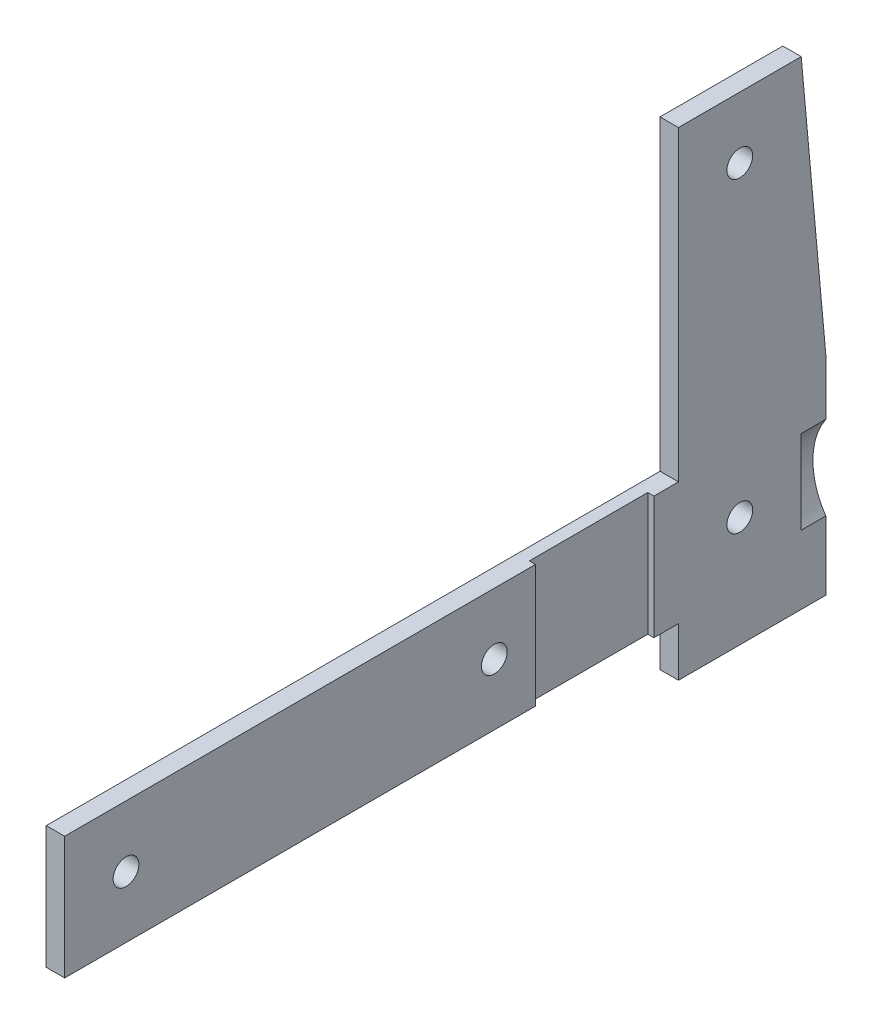
ISO-10303-21;
HEADER;
FILE_DESCRIPTION(('STEP AP214'),'2;1');
FILE_NAME('part.step','',(''),(''),'','','');
FILE_SCHEMA(('AUTOMOTIVE_DESIGN { 1 0 10303 214 1 1 1 1 }'));
ENDSEC;
DATA;
#1=APPLICATION_CONTEXT('core data for automotive mechanical design processes');
#2=APPLICATION_PROTOCOL_DEFINITION('international standard','automotive_design',2000,#1);
#3=PRODUCT_CONTEXT('',#1,'mechanical');
#4=PRODUCT('Part','Part','',(#3));
#5=PRODUCT_RELATED_PRODUCT_CATEGORY('part','',(#4));
#6=PRODUCT_DEFINITION_FORMATION('','',#4);
#7=PRODUCT_DEFINITION_CONTEXT('part definition',#1,'design');
#8=PRODUCT_DEFINITION('design','',#6,#7);
#9=PRODUCT_DEFINITION_SHAPE('','',#8);
#10=(LENGTH_UNIT() NAMED_UNIT(*) SI_UNIT(.MILLI.,.METRE.));
#11=(NAMED_UNIT(*) PLANE_ANGLE_UNIT() SI_UNIT($,.RADIAN.));
#12=(NAMED_UNIT(*) SI_UNIT($,.STERADIAN.) SOLID_ANGLE_UNIT());
#13=UNCERTAINTY_MEASURE_WITH_UNIT(LENGTH_MEASURE(1.E-05),#10,'distance_accuracy_value','');
#14=(GEOMETRIC_REPRESENTATION_CONTEXT(3) GLOBAL_UNCERTAINTY_ASSIGNED_CONTEXT((#13)) GLOBAL_UNIT_ASSIGNED_CONTEXT((#10,
#11,#12)) REPRESENTATION_CONTEXT('',''));
#15=CARTESIAN_POINT('',(0.,0.,0.));
#16=DIRECTION('',(0.,0.,1.));
#17=DIRECTION('',(1.,0.,0.));
#18=AXIS2_PLACEMENT_3D('',#15,#16,#17);
#19=CARTESIAN_POINT('',(0.,0.,309.000000000001));
#20=DIRECTION('',(0.,0.,1.));
#21=DIRECTION('',(0.,-1.,0.));
#22=AXIS2_PLACEMENT_3D('',#19,#20,#21);
#23=PLANE('',#22);
#24=CARTESIAN_POINT('',(0.,0.,309.000000000001));
#25=DIRECTION('',(0.,0.,-1.));
#26=DIRECTION('',(0.,1.,0.));
#27=AXIS2_PLACEMENT_3D('',#24,#25,#26);
#28=CIRCLE('',#27,12.1);
#29=CARTESIAN_POINT('',(-9.99999999999999,-6.81248853210037,309.000000000001));
#30=VERTEX_POINT('',#29);
#31=CARTESIAN_POINT('',(-9.99999999999999,6.8124885321005,309.000000000001));
#32=VERTEX_POINT('',#31);
#33=EDGE_CURVE('E19',#30,#32,#28,.T.);
#34=ORIENTED_EDGE('',*,*,#33,.T.);
#35=DIRECTION('',(0.,-1.,0.));
#36=VECTOR('',#35,1.);
#37=CARTESIAN_POINT('',(-10.,20.9999999999999,309.000000000001));
#38=LINE('',#37,#36);
#39=EDGE_CURVE('E120',#32,#30,#38,.T.);
#40=ORIENTED_EDGE('',*,*,#39,.T.);
#41=EDGE_LOOP('',(#34,#40));
#42=FACE_BOUND('',#41,.T.);
#43=ADVANCED_FACE('F16',(#42),#23,.F.);
#44=CARTESIAN_POINT('',(-10.,9.99999999999988,333.000000000001));
#45=DIRECTION('',(0.,0.,-1.));
#46=DIRECTION('',(-1.,0.,0.));
#47=AXIS2_PLACEMENT_3D('',#44,#45,#46);
#48=PLANE('',#47);
#49=DIRECTION('',(-1.,0.,0.));
#50=VECTOR('',#49,1.);
#51=CARTESIAN_POINT('',(-10.,9.99999999999988,333.000000000001));
#52=LINE('',#51,#50);
#53=CARTESIAN_POINT('',(-11.,9.99999999999988,333.000000000001));
#54=VERTEX_POINT('',#53);
#55=CARTESIAN_POINT('',(-10.,9.99999999999988,333.000000000001));
#56=VERTEX_POINT('',#55);
#57=EDGE_CURVE('E150',#54,#56,#52,.F.);
#58=ORIENTED_EDGE('',*,*,#57,.F.);
#59=DIRECTION('',(0.,1.,0.));
#60=VECTOR('',#59,1.);
#61=CARTESIAN_POINT('',(-11.,-1.4432899320127E-13,333.000000000001));
#62=LINE('',#61,#60);
#63=CARTESIAN_POINT('',(-11.,-10.0000000000002,333.000000000001));
#64=VERTEX_POINT('',#63);
#65=EDGE_CURVE('E141',#54,#64,#62,.F.);
#66=ORIENTED_EDGE('',*,*,#65,.T.);
#67=DIRECTION('',(-1.,0.,0.));
#68=VECTOR('',#67,1.);
#69=CARTESIAN_POINT('',(-10.,-10.0000000000002,333.000000000001));
#70=LINE('',#69,#68);
#71=CARTESIAN_POINT('',(-9.99999999999999,-10.0000000000002,333.000000000001));
#72=VERTEX_POINT('',#71);
#73=EDGE_CURVE('E152',#72,#64,#70,.T.);
#74=ORIENTED_EDGE('',*,*,#73,.F.);
#75=DIRECTION('',(0.,-1.,0.));
#76=VECTOR('',#75,1.);
#77=CARTESIAN_POINT('',(-10.,20.9999999999999,333.000000000001));
#78=LINE('',#77,#76);
#79=EDGE_CURVE('E136',#72,#56,#78,.F.);
#80=ORIENTED_EDGE('',*,*,#79,.T.);
#81=EDGE_LOOP('',(#58,#66,#74,#80));
#82=FACE_BOUND('',#81,.T.);
#83=ADVANCED_FACE('F263',(#82),#48,.F.);
#84=CARTESIAN_POINT('',(-10.,-10.0000000000002,352.300000000001));
#85=DIRECTION('',(0.,0.,1.));
#86=DIRECTION('',(1.,0.,0.));
#87=AXIS2_PLACEMENT_3D('',#84,#85,#86);
#88=PLANE('',#87);
#89=DIRECTION('',(1.,0.,0.));
#90=VECTOR('',#89,1.);
#91=CARTESIAN_POINT('',(-10.,-10.0000000000002,352.300000000001));
#92=LINE('',#91,#90);
#93=CARTESIAN_POINT('',(-11.,-10.0000000000002,352.300000000001));
#94=VERTEX_POINT('',#93);
#95=CARTESIAN_POINT('',(-10.,-10.0000000000002,352.300000000001));
#96=VERTEX_POINT('',#95);
#97=EDGE_CURVE('E126',#94,#96,#92,.T.);
#98=ORIENTED_EDGE('',*,*,#97,.F.);
#99=DIRECTION('',(0.,1.,0.));
#100=VECTOR('',#99,1.);
#101=CARTESIAN_POINT('',(-11.,-1.4432899320127E-13,352.300000000001));
#102=LINE('',#101,#100);
#103=CARTESIAN_POINT('',(-11.,9.99999999999988,352.300000000001));
#104=VERTEX_POINT('',#103);
#105=EDGE_CURVE('E125',#94,#104,#102,.T.);
#106=ORIENTED_EDGE('',*,*,#105,.T.);
#107=DIRECTION('',(1.,0.,0.));
#108=VECTOR('',#107,1.);
#109=CARTESIAN_POINT('',(-10.,9.99999999999988,352.300000000001));
#110=LINE('',#109,#108);
#111=CARTESIAN_POINT('',(-10.,9.99999999999988,352.300000000001));
#112=VERTEX_POINT('',#111);
#113=EDGE_CURVE('E148',#112,#104,#110,.F.);
#114=ORIENTED_EDGE('',*,*,#113,.F.);
#115=DIRECTION('',(0.,-1.,0.));
#116=VECTOR('',#115,1.);
#117=CARTESIAN_POINT('',(-10.,20.9999999999999,352.300000000001));
#118=LINE('',#117,#116);
#119=EDGE_CURVE('E135',#112,#96,#118,.T.);
#120=ORIENTED_EDGE('',*,*,#119,.T.);
#121=EDGE_LOOP('',(#98,#106,#114,#120));
#122=FACE_BOUND('',#121,.T.);
#123=ADVANCED_FACE('F256',(#122),#88,.F.);
#124=CARTESIAN_POINT('',(0.,0.,309.000000000001));
#125=DIRECTION('',(0.,0.,-1.));
#126=DIRECTION('',(0.,1.,0.));
#127=AXIS2_PLACEMENT_3D('',#124,#125,#126);
#128=CYLINDRICAL_SURFACE('',#127,12.1);
#129=ORIENTED_EDGE('',*,*,#33,.F.);
#130=DIRECTION('',(0.,0.,1.));
#131=VECTOR('',#130,1.);
#132=CARTESIAN_POINT('',(-9.99999999999999,-6.81248853210035,367.000000000001));
#133=LINE('',#132,#131);
#134=CARTESIAN_POINT('',(-9.99999999999999,-6.81248853210036,305.000000000001));
#135=VERTEX_POINT('',#134);
#136=EDGE_CURVE('E140',#30,#135,#133,.F.);
#137=ORIENTED_EDGE('',*,*,#136,.T.);
#138=CARTESIAN_POINT('',(0.,0.,305.000000000001));
#139=DIRECTION('',(0.,0.,-1.));
#140=DIRECTION('',(0.,1.,0.));
#141=AXIS2_PLACEMENT_3D('',#138,#139,#140);
#142=CIRCLE('',#141,12.1);
#143=CARTESIAN_POINT('',(-10.,6.8124885321005,305.000000000001));
#144=VERTEX_POINT('',#143);
#145=EDGE_CURVE('E131',#144,#135,#142,.F.);
#146=ORIENTED_EDGE('',*,*,#145,.F.);
#147=DIRECTION('',(0.,0.,1.));
#148=VECTOR('',#147,1.);
#149=CARTESIAN_POINT('',(-9.99999999999999,6.81248853210048,367.000000000001));
#150=LINE('',#149,#148);
#151=EDGE_CURVE('E128',#144,#32,#150,.T.);
#152=ORIENTED_EDGE('',*,*,#151,.T.);
#153=EDGE_LOOP('',(#129,#137,#146,#152));
#154=FACE_BOUND('',#153,.T.);
#155=ADVANCED_FACE('F129',(#154),#128,.F.);
#156=CARTESIAN_POINT('',(-11.,-1.4432899320127E-13,342.650000000001));
#157=DIRECTION('',(-1.,0.,0.));
#158=DIRECTION('',(0.,0.,1.));
#159=AXIS2_PLACEMENT_3D('',#156,#157,#158);
#160=PLANE('',#159);
#161=ORIENTED_EDGE('',*,*,#65,.F.);
#162=DIRECTION('',(0.,0.,1.));
#163=VECTOR('',#162,1.);
#164=CARTESIAN_POINT('',(-11.,9.99999999999987,429.000000000001));
#165=LINE('',#164,#163);
#166=EDGE_CURVE('E166',#104,#54,#165,.F.);
#167=ORIENTED_EDGE('',*,*,#166,.F.);
#168=ORIENTED_EDGE('',*,*,#105,.F.);
#169=DIRECTION('',(0.,0.,1.));
#170=VECTOR('',#169,1.);
#171=CARTESIAN_POINT('',(-11.,-10.0000000000002,329.000000000001));
#172=LINE('',#171,#170);
#173=EDGE_CURVE('E173',#64,#94,#172,.T.);
#174=ORIENTED_EDGE('',*,*,#173,.F.);
#175=EDGE_LOOP('',(#161,#167,#168,#174));
#176=FACE_BOUND('',#175,.T.);
#177=ADVANCED_FACE('F261',(#176),#160,.F.);
#178=CARTESIAN_POINT('',(-10.,20.9999999999999,367.000000000001));
#179=DIRECTION('',(-1.,0.,0.));
#180=DIRECTION('',(0.,-1.,0.));
#181=AXIS2_PLACEMENT_3D('',#178,#179,#180);
#182=PLANE('',#181);
#183=CARTESIAN_POINT('',(-10.,-1.19583449414767E-13,319.000000000001));
#184=DIRECTION('',(-1.,0.,0.));
#185=DIRECTION('',(0.,-1.,0.));
#186=AXIS2_PLACEMENT_3D('',#183,#184,#185);
#187=CIRCLE('',#186,2.09999999999999);
#188=CARTESIAN_POINT('',(-10.,-2.10000000000011,319.000000000001));
#189=VERTEX_POINT('',#188);
#190=EDGE_CURVE('E161',#189,#189,#187,.T.);
#191=ORIENTED_EDGE('',*,*,#190,.T.);
#192=EDGE_LOOP('',(#191));
#193=FACE_BOUND('',#192,.T.);
#194=CARTESIAN_POINT('',(-10.,49.9999999999999,319.000000000001));
#195=DIRECTION('',(-1.,0.,0.));
#196=DIRECTION('',(0.,-1.,0.));
#197=AXIS2_PLACEMENT_3D('',#194,#195,#196);
#198=CIRCLE('',#197,2.1);
#199=CARTESIAN_POINT('',(-10.,47.8999999999999,319.000000000001));
#200=VERTEX_POINT('',#199);
#201=EDGE_CURVE('E196',#200,#200,#198,.T.);
#202=ORIENTED_EDGE('',*,*,#201,.T.);
#203=EDGE_LOOP('',(#202));
#204=FACE_BOUND('',#203,.T.);
#205=DIRECTION('',(0.,1.,0.));
#206=VECTOR('',#205,1.);
#207=CARTESIAN_POINT('',(-10.,16.0497443313968,305.000000000001));
#208=LINE('',#207,#206);
#209=CARTESIAN_POINT('',(-10.,16.0497443313968,305.000000000001));
#210=VERTEX_POINT('',#209);
#211=EDGE_CURVE('E297',#210,#144,#208,.F.);
#212=ORIENTED_EDGE('',*,*,#211,.F.);
#213=DIRECTION('',(0.,0.995883962151565,0.0906373760062565));
#214=VECTOR('',#213,1.);
#215=CARTESIAN_POINT('',(-10.,59.9999999999999,309.000000000001));
#216=LINE('',#215,#214);
#217=CARTESIAN_POINT('',(-10.,59.9999999999999,309.000000000001));
#218=VERTEX_POINT('',#217);
#219=EDGE_CURVE('E207',#218,#210,#216,.F.);
#220=ORIENTED_EDGE('',*,*,#219,.F.);
#221=DIRECTION('',(0.,0.,1.));
#222=VECTOR('',#221,1.);
#223=CARTESIAN_POINT('',(-10.,59.9999999999999,329.000000000001));
#224=LINE('',#223,#222);
#225=CARTESIAN_POINT('',(-10.,59.9999999999999,329.000000000001));
#226=VERTEX_POINT('',#225);
#227=EDGE_CURVE('E226',#226,#218,#224,.F.);
#228=ORIENTED_EDGE('',*,*,#227,.F.);
#229=DIRECTION('',(0.,-1.,0.));
#230=VECTOR('',#229,1.);
#231=CARTESIAN_POINT('',(-10.,9.99999999999988,329.000000000001));
#232=LINE('',#231,#230);
#233=CARTESIAN_POINT('',(-10.,9.99999999999988,329.000000000001));
#234=VERTEX_POINT('',#233);
#235=EDGE_CURVE('E169',#234,#226,#232,.F.);
#236=ORIENTED_EDGE('',*,*,#235,.F.);
#237=DIRECTION('',(0.,0.,1.));
#238=VECTOR('',#237,1.);
#239=CARTESIAN_POINT('',(-10.,9.99999999999987,429.000000000001));
#240=LINE('',#239,#238);
#241=EDGE_CURVE('E229',#56,#234,#240,.F.);
#242=ORIENTED_EDGE('',*,*,#241,.F.);
#243=ORIENTED_EDGE('',*,*,#79,.F.);
#244=DIRECTION('',(0.,0.,1.));
#245=VECTOR('',#244,1.);
#246=CARTESIAN_POINT('',(-10.,-10.0000000000002,329.000000000001));
#247=LINE('',#246,#245);
#248=CARTESIAN_POINT('',(-10.,-10.0000000000002,329.000000000001));
#249=VERTEX_POINT('',#248);
#250=EDGE_CURVE('E158',#249,#72,#247,.T.);
#251=ORIENTED_EDGE('',*,*,#250,.F.);
#252=DIRECTION('',(0.,-1.,0.));
#253=VECTOR('',#252,1.);
#254=CARTESIAN_POINT('',(-10.,-18.,329.000000000001));
#255=LINE('',#254,#253);
#256=CARTESIAN_POINT('',(-9.99999999999999,-18.,329.000000000001));
#257=VERTEX_POINT('',#256);
#258=EDGE_CURVE('E294',#257,#249,#255,.F.);
#259=ORIENTED_EDGE('',*,*,#258,.F.);
#260=DIRECTION('',(0.,0.,1.));
#261=VECTOR('',#260,1.);
#262=CARTESIAN_POINT('',(-10.,-18.,305.000000000001));
#263=LINE('',#262,#261);
#264=CARTESIAN_POINT('',(-10.,-18.,305.000000000001));
#265=VERTEX_POINT('',#264);
#266=EDGE_CURVE('E299',#265,#257,#263,.T.);
#267=ORIENTED_EDGE('',*,*,#266,.F.);
#268=DIRECTION('',(0.,1.,0.));
#269=VECTOR('',#268,1.);
#270=CARTESIAN_POINT('',(-10.,16.0497443313968,305.000000000001));
#271=LINE('',#270,#269);
#272=EDGE_CURVE('E200',#135,#265,#271,.F.);
#273=ORIENTED_EDGE('',*,*,#272,.F.);
#274=ORIENTED_EDGE('',*,*,#136,.F.);
#275=ORIENTED_EDGE('',*,*,#39,.F.);
#276=ORIENTED_EDGE('',*,*,#151,.F.);
#277=EDGE_LOOP('',(#212,#220,#228,#236,#242,#243,#251,#259,#267,#273,#274,#275,#276));
#278=FACE_BOUND('',#277,.T.);
#279=ADVANCED_FACE('F138',(#193,#204,#278),#182,.F.);
#280=CARTESIAN_POINT('',(-10.,20.9999999999999,367.000000000001));
#281=DIRECTION('',(-1.,0.,0.));
#282=DIRECTION('',(0.,-1.,0.));
#283=AXIS2_PLACEMENT_3D('',#280,#281,#282);
#284=PLANE('',#283);
#285=CARTESIAN_POINT('',(-10.,-1.82269356388673E-13,359.000000000001));
#286=DIRECTION('',(-1.,0.,0.));
#287=DIRECTION('',(0.,-1.,0.));
#288=AXIS2_PLACEMENT_3D('',#285,#286,#287);
#289=CIRCLE('',#288,2.1);
#290=CARTESIAN_POINT('',(-10.,-2.10000000000018,359.000000000001));
#291=VERTEX_POINT('',#290);
#292=EDGE_CURVE('E189',#291,#291,#289,.T.);
#293=ORIENTED_EDGE('',*,*,#292,.T.);
#294=EDGE_LOOP('',(#293));
#295=FACE_BOUND('',#294,.T.);
#296=CARTESIAN_POINT('',(-10.,-1.83630888273001E-13,419.000000000001));
#297=DIRECTION('',(-1.,0.,0.));
#298=DIRECTION('',(0.,-1.,0.));
#299=AXIS2_PLACEMENT_3D('',#296,#297,#298);
#300=CIRCLE('',#299,2.1);
#301=CARTESIAN_POINT('',(-10.,-2.10000000000018,419.000000000001));
#302=VERTEX_POINT('',#301);
#303=EDGE_CURVE('E193',#302,#302,#300,.T.);
#304=ORIENTED_EDGE('',*,*,#303,.T.);
#305=EDGE_LOOP('',(#304));
#306=FACE_BOUND('',#305,.T.);
#307=DIRECTION('',(0.,0.,1.));
#308=VECTOR('',#307,1.);
#309=CARTESIAN_POINT('',(-10.,9.99999999999987,429.000000000001));
#310=LINE('',#309,#308);
#311=CARTESIAN_POINT('',(-10.,9.99999999999987,429.000000000001));
#312=VERTEX_POINT('',#311);
#313=EDGE_CURVE('E170',#312,#112,#310,.F.);
#314=ORIENTED_EDGE('',*,*,#313,.F.);
#315=DIRECTION('',(0.,-1.,0.));
#316=VECTOR('',#315,1.);
#317=CARTESIAN_POINT('',(-10.,-10.0000000000002,429.000000000001));
#318=LINE('',#317,#316);
#319=CARTESIAN_POINT('',(-9.99999999999999,-10.0000000000002,429.000000000001));
#320=VERTEX_POINT('',#319);
#321=EDGE_CURVE('E233',#320,#312,#318,.F.);
#322=ORIENTED_EDGE('',*,*,#321,.F.);
#323=DIRECTION('',(0.,0.,1.));
#324=VECTOR('',#323,1.);
#325=CARTESIAN_POINT('',(-10.,-10.0000000000002,329.000000000001));
#326=LINE('',#325,#324);
#327=EDGE_CURVE('E176',#96,#320,#326,.T.);
#328=ORIENTED_EDGE('',*,*,#327,.F.);
#329=ORIENTED_EDGE('',*,*,#119,.F.);
#330=EDGE_LOOP('',(#314,#322,#328,#329));
#331=FACE_BOUND('',#330,.T.);
#332=ADVANCED_FACE('F350',(#295,#306,#331),#284,.F.);
#333=CARTESIAN_POINT('',(-10.,-10.0000000000002,429.000000000001));
#334=DIRECTION('',(0.,0.,1.));
#335=DIRECTION('',(0.,-1.,0.));
#336=AXIS2_PLACEMENT_3D('',#333,#334,#335);
#337=PLANE('',#336);
#338=DIRECTION('',(0.,-1.,0.));
#339=VECTOR('',#338,1.);
#340=CARTESIAN_POINT('',(-13.,20.9999999999999,429.000000000001));
#341=LINE('',#340,#339);
#342=CARTESIAN_POINT('',(-13.,-10.0000000000002,429.000000000001));
#343=VERTEX_POINT('',#342);
#344=CARTESIAN_POINT('',(-13.,9.99999999999987,429.000000000001));
#345=VERTEX_POINT('',#344);
#346=EDGE_CURVE('E192',#343,#345,#341,.F.);
#347=ORIENTED_EDGE('',*,*,#346,.F.);
#348=DIRECTION('',(1.,0.,0.));
#349=VECTOR('',#348,1.);
#350=CARTESIAN_POINT('',(-10.,-10.0000000000002,429.000000000001));
#351=LINE('',#350,#349);
#352=EDGE_CURVE('E288',#320,#343,#351,.F.);
#353=ORIENTED_EDGE('',*,*,#352,.F.);
#354=ORIENTED_EDGE('',*,*,#321,.T.);
#355=DIRECTION('',(-1.,0.,0.));
#356=VECTOR('',#355,1.);
#357=CARTESIAN_POINT('',(-10.,9.99999999999987,429.000000000001));
#358=LINE('',#357,#356);
#359=EDGE_CURVE('E232',#345,#312,#358,.F.);
#360=ORIENTED_EDGE('',*,*,#359,.F.);
#361=EDGE_LOOP('',(#347,#353,#354,#360));
#362=FACE_BOUND('',#361,.T.);
#363=ADVANCED_FACE('F348',(#362),#337,.T.);
#364=CARTESIAN_POINT('',(-10.,9.99999999999987,429.000000000001));
#365=DIRECTION('',(0.,1.,0.));
#366=DIRECTION('',(-1.,0.,0.));
#367=AXIS2_PLACEMENT_3D('',#364,#365,#366);
#368=PLANE('',#367);
#369=ORIENTED_EDGE('',*,*,#113,.T.);
#370=ORIENTED_EDGE('',*,*,#166,.T.);
#371=ORIENTED_EDGE('',*,*,#57,.T.);
#372=ORIENTED_EDGE('',*,*,#241,.T.);
#373=DIRECTION('',(1.,0.,0.));
#374=VECTOR('',#373,1.);
#375=CARTESIAN_POINT('',(-10.,9.99999999999988,329.000000000001));
#376=LINE('',#375,#374);
#377=CARTESIAN_POINT('',(-13.,9.99999999999987,329.000000000001));
#378=VERTEX_POINT('',#377);
#379=EDGE_CURVE('E221',#378,#234,#376,.T.);
#380=ORIENTED_EDGE('',*,*,#379,.F.);
#381=DIRECTION('',(0.,0.,1.));
#382=VECTOR('',#381,1.);
#383=CARTESIAN_POINT('',(-13.,9.99999999999987,367.000000000001));
#384=LINE('',#383,#382);
#385=EDGE_CURVE('E277',#345,#378,#384,.F.);
#386=ORIENTED_EDGE('',*,*,#385,.F.);
#387=ORIENTED_EDGE('',*,*,#359,.T.);
#388=ORIENTED_EDGE('',*,*,#313,.T.);
#389=EDGE_LOOP('',(#369,#370,#371,#372,#380,#386,#387,#388));
#390=FACE_BOUND('',#389,.T.);
#391=ADVANCED_FACE('F249',(#390),#368,.T.);
#392=CARTESIAN_POINT('',(-10.,9.99999999999988,329.000000000001));
#393=DIRECTION('',(0.,0.,1.));
#394=DIRECTION('',(0.,-1.,0.));
#395=AXIS2_PLACEMENT_3D('',#392,#393,#394);
#396=PLANE('',#395);
#397=DIRECTION('',(0.,-1.,0.));
#398=VECTOR('',#397,1.);
#399=CARTESIAN_POINT('',(-13.,20.9999999999999,329.000000000001));
#400=LINE('',#399,#398);
#401=CARTESIAN_POINT('',(-13.,59.9999999999999,329.000000000001));
#402=VERTEX_POINT('',#401);
#403=EDGE_CURVE('E271',#378,#402,#400,.F.);
#404=ORIENTED_EDGE('',*,*,#403,.F.);
#405=ORIENTED_EDGE('',*,*,#379,.T.);
#406=ORIENTED_EDGE('',*,*,#235,.T.);
#407=DIRECTION('',(-1.,0.,0.));
#408=VECTOR('',#407,1.);
#409=CARTESIAN_POINT('',(-10.,59.9999999999999,329.000000000001));
#410=LINE('',#409,#408);
#411=EDGE_CURVE('E211',#402,#226,#410,.F.);
#412=ORIENTED_EDGE('',*,*,#411,.F.);
#413=EDGE_LOOP('',(#404,#405,#406,#412));
#414=FACE_BOUND('',#413,.T.);
#415=ADVANCED_FACE('F269',(#414),#396,.T.);
#416=CARTESIAN_POINT('',(-10.,59.9999999999999,329.000000000001));
#417=DIRECTION('',(0.,1.,0.));
#418=DIRECTION('',(-1.,0.,0.));
#419=AXIS2_PLACEMENT_3D('',#416,#417,#418);
#420=PLANE('',#419);
#421=DIRECTION('',(0.,0.,1.));
#422=VECTOR('',#421,1.);
#423=CARTESIAN_POINT('',(-13.,59.9999999999999,367.000000000001));
#424=LINE('',#423,#422);
#425=CARTESIAN_POINT('',(-13.,59.9999999999999,309.000000000001));
#426=VERTEX_POINT('',#425);
#427=EDGE_CURVE('E276',#402,#426,#424,.F.);
#428=ORIENTED_EDGE('',*,*,#427,.F.);
#429=ORIENTED_EDGE('',*,*,#411,.T.);
#430=ORIENTED_EDGE('',*,*,#227,.T.);
#431=DIRECTION('',(1.,0.,0.));
#432=VECTOR('',#431,1.);
#433=CARTESIAN_POINT('',(-10.,59.9999999999999,309.000000000001));
#434=LINE('',#433,#432);
#435=EDGE_CURVE('E201',#426,#218,#434,.T.);
#436=ORIENTED_EDGE('',*,*,#435,.F.);
#437=EDGE_LOOP('',(#428,#429,#430,#436));
#438=FACE_BOUND('',#437,.T.);
#439=ADVANCED_FACE('F334',(#438),#420,.T.);
#440=CARTESIAN_POINT('',(-10.,59.9999999999999,309.000000000001));
#441=DIRECTION('',(0.,0.0906373760062565,-0.995883962151565));
#442=DIRECTION('',(0.,0.995883962151565,0.0906373760062565));
#443=AXIS2_PLACEMENT_3D('',#440,#441,#442);
#444=PLANE('',#443);
#445=DIRECTION('',(0.,-0.995883962151565,-0.0906373760062561));
#446=VECTOR('',#445,1.);
#447=CARTESIAN_POINT('',(-13.,59.9999999999999,309.000000000001));
#448=LINE('',#447,#446);
#449=CARTESIAN_POINT('',(-13.,16.0497443313968,305.000000000001));
#450=VERTEX_POINT('',#449);
#451=EDGE_CURVE('E318',#426,#450,#448,.T.);
#452=ORIENTED_EDGE('',*,*,#451,.F.);
#453=ORIENTED_EDGE('',*,*,#435,.T.);
#454=ORIENTED_EDGE('',*,*,#219,.T.);
#455=DIRECTION('',(1.,0.,0.));
#456=VECTOR('',#455,1.);
#457=CARTESIAN_POINT('',(-10.,16.0497443313968,305.000000000001));
#458=LINE('',#457,#456);
#459=EDGE_CURVE('E204',#450,#210,#458,.T.);
#460=ORIENTED_EDGE('',*,*,#459,.F.);
#461=EDGE_LOOP('',(#452,#453,#454,#460));
#462=FACE_BOUND('',#461,.T.);
#463=ADVANCED_FACE('F335',(#462),#444,.T.);
#464=CARTESIAN_POINT('',(-10.,16.0497443313968,305.000000000001));
#465=DIRECTION('',(0.,0.,-1.));
#466=DIRECTION('',(0.,1.,0.));
#467=AXIS2_PLACEMENT_3D('',#464,#465,#466);
#468=PLANE('',#467);
#469=ORIENTED_EDGE('',*,*,#459,.T.);
#470=ORIENTED_EDGE('',*,*,#211,.T.);
#471=ORIENTED_EDGE('',*,*,#145,.T.);
#472=ORIENTED_EDGE('',*,*,#272,.T.);
#473=DIRECTION('',(1.,0.,0.));
#474=VECTOR('',#473,1.);
#475=CARTESIAN_POINT('',(-10.,-18.,305.000000000001));
#476=LINE('',#475,#474);
#477=CARTESIAN_POINT('',(-13.,-18.,305.000000000001));
#478=VERTEX_POINT('',#477);
#479=EDGE_CURVE('E296',#478,#265,#476,.T.);
#480=ORIENTED_EDGE('',*,*,#479,.F.);
#481=DIRECTION('',(0.,-1.,0.));
#482=VECTOR('',#481,1.);
#483=CARTESIAN_POINT('',(-13.,20.9999999999999,305.000000000001));
#484=LINE('',#483,#482);
#485=EDGE_CURVE('E314',#450,#478,#484,.T.);
#486=ORIENTED_EDGE('',*,*,#485,.F.);
#487=EDGE_LOOP('',(#469,#470,#471,#472,#480,#486));
#488=FACE_BOUND('',#487,.T.);
#489=ADVANCED_FACE('F337',(#488),#468,.T.);
#490=CARTESIAN_POINT('',(-10.,-18.,305.000000000001));
#491=DIRECTION('',(0.,-1.,0.));
#492=DIRECTION('',(1.,0.,0.));
#493=AXIS2_PLACEMENT_3D('',#490,#491,#492);
#494=PLANE('',#493);
#495=DIRECTION('',(0.,0.,1.));
#496=VECTOR('',#495,1.);
#497=CARTESIAN_POINT('',(-13.,-18.,367.000000000001));
#498=LINE('',#497,#496);
#499=CARTESIAN_POINT('',(-13.,-18.,329.000000000001));
#500=VERTEX_POINT('',#499);
#501=EDGE_CURVE('E317',#478,#500,#498,.T.);
#502=ORIENTED_EDGE('',*,*,#501,.F.);
#503=ORIENTED_EDGE('',*,*,#479,.T.);
#504=ORIENTED_EDGE('',*,*,#266,.T.);
#505=DIRECTION('',(1.,0.,0.));
#506=VECTOR('',#505,1.);
#507=CARTESIAN_POINT('',(-10.,-18.,329.000000000001));
#508=LINE('',#507,#506);
#509=EDGE_CURVE('E177',#500,#257,#508,.T.);
#510=ORIENTED_EDGE('',*,*,#509,.F.);
#511=EDGE_LOOP('',(#502,#503,#504,#510));
#512=FACE_BOUND('',#511,.T.);
#513=ADVANCED_FACE('F391',(#512),#494,.T.);
#514=CARTESIAN_POINT('',(-10.,-18.,329.000000000001));
#515=DIRECTION('',(0.,0.,1.));
#516=DIRECTION('',(0.,-1.,0.));
#517=AXIS2_PLACEMENT_3D('',#514,#515,#516);
#518=PLANE('',#517);
#519=DIRECTION('',(0.,-1.,0.));
#520=VECTOR('',#519,1.);
#521=CARTESIAN_POINT('',(-13.,20.9999999999999,329.000000000001));
#522=LINE('',#521,#520);
#523=CARTESIAN_POINT('',(-13.,-10.0000000000002,329.000000000001));
#524=VERTEX_POINT('',#523);
#525=EDGE_CURVE('E342',#500,#524,#522,.F.);
#526=ORIENTED_EDGE('',*,*,#525,.F.);
#527=ORIENTED_EDGE('',*,*,#509,.T.);
#528=ORIENTED_EDGE('',*,*,#258,.T.);
#529=DIRECTION('',(1.,0.,0.));
#530=VECTOR('',#529,1.);
#531=CARTESIAN_POINT('',(-10.,-10.0000000000002,329.000000000001));
#532=LINE('',#531,#530);
#533=EDGE_CURVE('E34',#524,#249,#532,.T.);
#534=ORIENTED_EDGE('',*,*,#533,.F.);
#535=EDGE_LOOP('',(#526,#527,#528,#534));
#536=FACE_BOUND('',#535,.T.);
#537=ADVANCED_FACE('F388',(#536),#518,.T.);
#538=CARTESIAN_POINT('',(-10.,-10.0000000000002,329.000000000001));
#539=DIRECTION('',(0.,-1.,0.));
#540=DIRECTION('',(1.,0.,0.));
#541=AXIS2_PLACEMENT_3D('',#538,#539,#540);
#542=PLANE('',#541);
#543=ORIENTED_EDGE('',*,*,#533,.T.);
#544=ORIENTED_EDGE('',*,*,#250,.T.);
#545=ORIENTED_EDGE('',*,*,#73,.T.);
#546=ORIENTED_EDGE('',*,*,#173,.T.);
#547=ORIENTED_EDGE('',*,*,#97,.T.);
#548=ORIENTED_EDGE('',*,*,#327,.T.);
#549=ORIENTED_EDGE('',*,*,#352,.T.);
#550=DIRECTION('',(0.,0.,1.));
#551=VECTOR('',#550,1.);
#552=CARTESIAN_POINT('',(-13.,-10.0000000000002,367.000000000001));
#553=LINE('',#552,#551);
#554=EDGE_CURVE('E188',#524,#343,#553,.T.);
#555=ORIENTED_EDGE('',*,*,#554,.F.);
#556=EDGE_LOOP('',(#543,#544,#545,#546,#547,#548,#549,#555));
#557=FACE_BOUND('',#556,.T.);
#558=ADVANCED_FACE('F344',(#557),#542,.T.);
#559=CARTESIAN_POINT('',(-10.,-1.19583449414767E-13,319.000000000001));
#560=DIRECTION('',(-1.,0.,0.));
#561=DIRECTION('',(0.,-1.,0.));
#562=AXIS2_PLACEMENT_3D('',#559,#560,#561);
#563=CYLINDRICAL_SURFACE('',#562,2.09999999999999);
#564=ORIENTED_EDGE('',*,*,#190,.F.);
#565=EDGE_LOOP('',(#564));
#566=FACE_BOUND('',#565,.T.);
#567=CARTESIAN_POINT('',(-13.,-1.20971228195548E-13,319.000000000001));
#568=DIRECTION('',(-1.,0.,0.));
#569=DIRECTION('',(0.,-1.,0.));
#570=AXIS2_PLACEMENT_3D('',#567,#568,#569);
#571=CIRCLE('',#570,2.09999999999999);
#572=CARTESIAN_POINT('',(-13.,-2.10000000000011,319.000000000001));
#573=VERTEX_POINT('',#572);
#574=EDGE_CURVE('E185',#573,#573,#571,.F.);
#575=ORIENTED_EDGE('',*,*,#574,.F.);
#576=EDGE_LOOP('',(#575));
#577=FACE_BOUND('',#576,.T.);
#578=ADVANCED_FACE('F381',(#566,#577),#563,.F.);
#579=CARTESIAN_POINT('',(-10.,49.9999999999999,319.000000000001));
#580=DIRECTION('',(-1.,0.,0.));
#581=DIRECTION('',(0.,-1.,0.));
#582=AXIS2_PLACEMENT_3D('',#579,#580,#581);
#583=CYLINDRICAL_SURFACE('',#582,2.1);
#584=ORIENTED_EDGE('',*,*,#201,.F.);
#585=EDGE_LOOP('',(#584));
#586=FACE_BOUND('',#585,.T.);
#587=CARTESIAN_POINT('',(-13.,49.9999999999999,319.000000000001));
#588=DIRECTION('',(-1.,0.,0.));
#589=DIRECTION('',(0.,-1.,0.));
#590=AXIS2_PLACEMENT_3D('',#587,#588,#589);
#591=CIRCLE('',#590,2.1);
#592=CARTESIAN_POINT('',(-13.,47.8999999999999,319.000000000001));
#593=VERTEX_POINT('',#592);
#594=EDGE_CURVE('E182',#593,#593,#591,.F.);
#595=ORIENTED_EDGE('',*,*,#594,.F.);
#596=EDGE_LOOP('',(#595));
#597=FACE_BOUND('',#596,.T.);
#598=ADVANCED_FACE('F377',(#586,#597),#583,.F.);
#599=CARTESIAN_POINT('',(-10.,-1.83630888273001E-13,419.000000000001));
#600=DIRECTION('',(-1.,0.,0.));
#601=DIRECTION('',(0.,-1.,0.));
#602=AXIS2_PLACEMENT_3D('',#599,#600,#601);
#603=CYLINDRICAL_SURFACE('',#602,2.1);
#604=ORIENTED_EDGE('',*,*,#303,.F.);
#605=EDGE_LOOP('',(#604));
#606=FACE_BOUND('',#605,.T.);
#607=CARTESIAN_POINT('',(-13.,-1.85018667053782E-13,419.000000000001));
#608=DIRECTION('',(-1.,0.,0.));
#609=DIRECTION('',(0.,-1.,0.));
#610=AXIS2_PLACEMENT_3D('',#607,#608,#609);
#611=CIRCLE('',#610,2.1);
#612=CARTESIAN_POINT('',(-13.,-2.10000000000019,419.000000000001));
#613=VERTEX_POINT('',#612);
#614=EDGE_CURVE('E25',#613,#613,#611,.F.);
#615=ORIENTED_EDGE('',*,*,#614,.F.);
#616=EDGE_LOOP('',(#615));
#617=FACE_BOUND('',#616,.T.);
#618=ADVANCED_FACE('F370',(#606,#617),#603,.F.);
#619=CARTESIAN_POINT('',(-10.,-1.82269356388673E-13,359.000000000001));
#620=DIRECTION('',(-1.,0.,0.));
#621=DIRECTION('',(0.,-1.,0.));
#622=AXIS2_PLACEMENT_3D('',#619,#620,#621);
#623=CYLINDRICAL_SURFACE('',#622,2.1);
#624=ORIENTED_EDGE('',*,*,#292,.F.);
#625=EDGE_LOOP('',(#624));
#626=FACE_BOUND('',#625,.T.);
#627=CARTESIAN_POINT('',(-13.,-1.83657135169454E-13,359.000000000001));
#628=DIRECTION('',(-1.,0.,0.));
#629=DIRECTION('',(0.,-1.,0.));
#630=AXIS2_PLACEMENT_3D('',#627,#628,#629);
#631=CIRCLE('',#630,2.1);
#632=CARTESIAN_POINT('',(-13.,-2.10000000000018,359.000000000001));
#633=VERTEX_POINT('',#632);
#634=EDGE_CURVE('E11',#633,#633,#631,.F.);
#635=ORIENTED_EDGE('',*,*,#634,.F.);
#636=EDGE_LOOP('',(#635));
#637=FACE_BOUND('',#636,.T.);
#638=ADVANCED_FACE('F364',(#626,#637),#623,.F.);
#639=CARTESIAN_POINT('',(-13.,20.9999999999999,367.000000000001));
#640=DIRECTION('',(-1.,0.,0.));
#641=DIRECTION('',(0.,-1.,0.));
#642=AXIS2_PLACEMENT_3D('',#639,#640,#641);
#643=PLANE('',#642);
#644=ORIENTED_EDGE('',*,*,#634,.T.);
#645=EDGE_LOOP('',(#644));
#646=FACE_BOUND('',#645,.T.);
#647=ORIENTED_EDGE('',*,*,#614,.T.);
#648=EDGE_LOOP('',(#647));
#649=FACE_BOUND('',#648,.T.);
#650=ORIENTED_EDGE('',*,*,#594,.T.);
#651=EDGE_LOOP('',(#650));
#652=FACE_BOUND('',#651,.T.);
#653=ORIENTED_EDGE('',*,*,#574,.T.);
#654=EDGE_LOOP('',(#653));
#655=FACE_BOUND('',#654,.T.);
#656=ORIENTED_EDGE('',*,*,#525,.T.);
#657=ORIENTED_EDGE('',*,*,#554,.T.);
#658=ORIENTED_EDGE('',*,*,#346,.T.);
#659=ORIENTED_EDGE('',*,*,#385,.T.);
#660=ORIENTED_EDGE('',*,*,#403,.T.);
#661=ORIENTED_EDGE('',*,*,#427,.T.);
#662=ORIENTED_EDGE('',*,*,#451,.T.);
#663=ORIENTED_EDGE('',*,*,#485,.T.);
#664=ORIENTED_EDGE('',*,*,#501,.T.);
#665=EDGE_LOOP('',(#656,#657,#658,#659,#660,#661,#662,#663,#664));
#666=FACE_BOUND('',#665,.T.);
#667=ADVANCED_FACE('F281',(#646,#649,#652,#655,#666),#643,.T.);
#668=CLOSED_SHELL('',(#43,#83,#123,#155,#177,#279,#332,#363,#391,#415,#439,#463,#489,#513,#537,
#558,#578,#598,#618,#638,#667));
#669=MANIFOLD_SOLID_BREP('B1',#668);
#670=ADVANCED_BREP_SHAPE_REPRESENTATION('',(#18,#669),#14);
#671=SHAPE_DEFINITION_REPRESENTATION(#9,#670);
ENDSEC;
END-ISO-10303-21;
